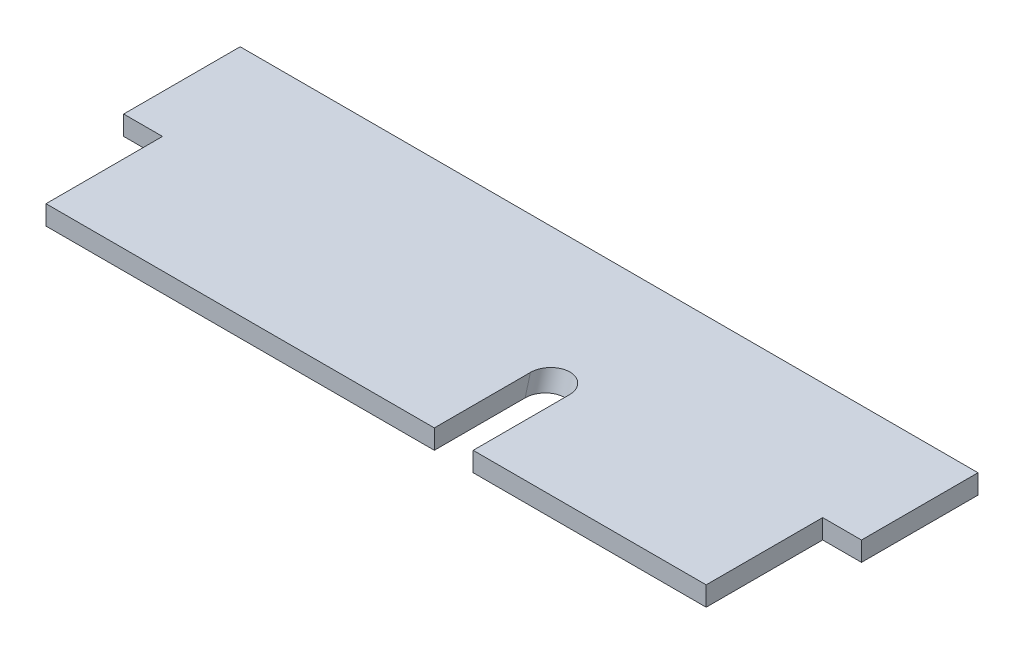
ISO-10303-21;
HEADER;
FILE_DESCRIPTION(('STEP AP214'),'2;1');
FILE_NAME('part.step','',(''),(''),'','','');
FILE_SCHEMA(('AUTOMOTIVE_DESIGN { 1 0 10303 214 1 1 1 1 }'));
ENDSEC;
DATA;
#1=APPLICATION_CONTEXT('core data for automotive mechanical design processes');
#2=APPLICATION_PROTOCOL_DEFINITION('international standard','automotive_design',2000,#1);
#3=PRODUCT_CONTEXT('',#1,'mechanical');
#4=PRODUCT('Part','Part','',(#3));
#5=PRODUCT_RELATED_PRODUCT_CATEGORY('part','',(#4));
#6=PRODUCT_DEFINITION_FORMATION('','',#4);
#7=PRODUCT_DEFINITION_CONTEXT('part definition',#1,'design');
#8=PRODUCT_DEFINITION('design','',#6,#7);
#9=PRODUCT_DEFINITION_SHAPE('','',#8);
#10=(LENGTH_UNIT() NAMED_UNIT(*) SI_UNIT(.MILLI.,.METRE.));
#11=(NAMED_UNIT(*) PLANE_ANGLE_UNIT() SI_UNIT($,.RADIAN.));
#12=(NAMED_UNIT(*) SI_UNIT($,.STERADIAN.) SOLID_ANGLE_UNIT());
#13=UNCERTAINTY_MEASURE_WITH_UNIT(LENGTH_MEASURE(1.E-05),#10,'distance_accuracy_value','');
#14=(GEOMETRIC_REPRESENTATION_CONTEXT(3) GLOBAL_UNCERTAINTY_ASSIGNED_CONTEXT((#13)) GLOBAL_UNIT_ASSIGNED_CONTEXT((#10,
#11,#12)) REPRESENTATION_CONTEXT('',''));
#15=CARTESIAN_POINT('',(0.,0.,0.));
#16=DIRECTION('',(0.,0.,1.));
#17=DIRECTION('',(1.,0.,0.));
#18=AXIS2_PLACEMENT_3D('',#15,#16,#17);
#19=CARTESIAN_POINT('',(-215.9,6.35,76.2));
#20=DIRECTION('',(0.,0.,-1.));
#21=DIRECTION('',(-1.,0.,0.));
#22=AXIS2_PLACEMENT_3D('',#19,#20,#21);
#23=PLANE('',#22);
#24=DIRECTION('',(1.,0.,0.));
#25=VECTOR('',#24,1.);
#26=CARTESIAN_POINT('',(-215.9,-6.35,76.2));
#27=LINE('',#26,#25);
#28=CARTESIAN_POINT('',(-215.9,-6.35,76.2));
#29=VERTEX_POINT('',#28);
#30=CARTESIAN_POINT('',(38.0999999999999,-6.35,76.2));
#31=VERTEX_POINT('',#30);
#32=EDGE_CURVE('E178',#29,#31,#27,.T.);
#33=ORIENTED_EDGE('',*,*,#32,.T.);
#34=DIRECTION('',(0.,-1.,0.));
#35=VECTOR('',#34,1.);
#36=CARTESIAN_POINT('',(38.0999999999999,6.34999999999999,76.2));
#37=LINE('',#36,#35);
#38=CARTESIAN_POINT('',(38.0999999999999,6.34999999999999,76.2));
#39=VERTEX_POINT('',#38);
#40=EDGE_CURVE('E275',#39,#31,#37,.T.);
#41=ORIENTED_EDGE('',*,*,#40,.F.);
#42=DIRECTION('',(1.,0.,0.));
#43=VECTOR('',#42,1.);
#44=CARTESIAN_POINT('',(-215.9,6.35,76.2));
#45=LINE('',#44,#43);
#46=CARTESIAN_POINT('',(-215.9,6.35,76.2));
#47=VERTEX_POINT('',#46);
#48=EDGE_CURVE('E56',#47,#39,#45,.T.);
#49=ORIENTED_EDGE('',*,*,#48,.F.);
#50=DIRECTION('',(0.,-1.,0.));
#51=VECTOR('',#50,1.);
#52=CARTESIAN_POINT('',(-215.9,6.35,76.2));
#53=LINE('',#52,#51);
#54=EDGE_CURVE('E172',#47,#29,#53,.T.);
#55=ORIENTED_EDGE('',*,*,#54,.T.);
#56=EDGE_LOOP('',(#33,#41,#49,#55));
#57=FACE_BOUND('',#56,.T.);
#58=ADVANCED_FACE('F46',(#57),#23,.F.);
#59=CARTESIAN_POINT('',(50.7999999999986,94.7896928963142,-10.6042856199856));
#60=DIRECTION('',(0.,-0.965182723476007,0.261576585923584));
#61=DIRECTION('',(0.,-0.261576585923584,-0.965182723476007));
#62=AXIS2_PLACEMENT_3D('',#59,#60,#61);
#63=CYLINDRICAL_SURFACE('',#62,12.7000000000001);
#64=CARTESIAN_POINT('',(50.7999999999986,6.34999999999999,13.363976933072));
#65=DIRECTION('',(0.,1.,0.));
#66=DIRECTION('',(0.,0.,1.));
#67=AXIS2_PLACEMENT_3D('',#64,#65,#66);
#68=ELLIPSE('',#67,13.1581302597941,12.7000000000001);
#69=CARTESIAN_POINT('',(38.0999999999992,6.34999999999999,13.363976933072));
#70=VERTEX_POINT('',#69);
#71=CARTESIAN_POINT('',(63.4999999999994,6.34999999999999,13.363976933072));
#72=VERTEX_POINT('',#71);
#73=EDGE_CURVE('E50',#70,#72,#68,.F.);
#74=ORIENTED_EDGE('',*,*,#73,.F.);
#75=DIRECTION('',(0.,-0.965182723476007,0.261576585923584));
#76=VECTOR('',#75,1.);
#77=CARTESIAN_POINT('',(38.0999999999992,94.7896928963142,-10.6042856199856));
#78=LINE('',#77,#76);
#79=CARTESIAN_POINT('',(38.0999999999985,-6.34999999999999,16.8058357235667));
#80=VERTEX_POINT('',#79);
#81=EDGE_CURVE('E151',#80,#70,#78,.F.);
#82=ORIENTED_EDGE('',*,*,#81,.F.);
#83=CARTESIAN_POINT('',(50.7999999999986,-6.34999999999999,16.8058357235667));
#84=DIRECTION('',(0.,1.,0.));
#85=DIRECTION('',(0.,0.,1.));
#86=AXIS2_PLACEMENT_3D('',#83,#84,#85);
#87=ELLIPSE('',#86,13.1581302597941,12.7000000000001);
#88=CARTESIAN_POINT('',(63.4999999999987,-6.34999999999999,16.8058357235667));
#89=VERTEX_POINT('',#88);
#90=EDGE_CURVE('E11',#80,#89,#87,.F.);
#91=ORIENTED_EDGE('',*,*,#90,.T.);
#92=DIRECTION('',(0.,-0.965182723476007,0.261576585923584));
#93=VECTOR('',#92,1.);
#94=CARTESIAN_POINT('',(63.4999999999994,94.7896928963142,-10.6042856199856));
#95=LINE('',#94,#93);
#96=EDGE_CURVE('E160',#89,#72,#95,.F.);
#97=ORIENTED_EDGE('',*,*,#96,.T.);
#98=EDGE_LOOP('',(#74,#82,#91,#97));
#99=FACE_BOUND('',#98,.T.);
#100=ADVANCED_FACE('F169',(#99),#63,.F.);
#101=CARTESIAN_POINT('',(215.9,6.35,0.));
#102=DIRECTION('',(-1.,0.,0.));
#103=DIRECTION('',(0.,0.,1.));
#104=AXIS2_PLACEMENT_3D('',#101,#102,#103);
#105=PLANE('',#104);
#106=DIRECTION('',(0.,0.,-1.));
#107=VECTOR('',#106,1.);
#108=CARTESIAN_POINT('',(215.9,-6.35,0.));
#109=LINE('',#108,#107);
#110=CARTESIAN_POINT('',(215.9,-6.35,76.2));
#111=VERTEX_POINT('',#110);
#112=CARTESIAN_POINT('',(215.9,-6.35,0.));
#113=VERTEX_POINT('',#112);
#114=EDGE_CURVE('E195',#111,#113,#109,.T.);
#115=ORIENTED_EDGE('',*,*,#114,.T.);
#116=DIRECTION('',(0.,-1.,0.));
#117=VECTOR('',#116,1.);
#118=CARTESIAN_POINT('',(215.9,6.35,0.));
#119=LINE('',#118,#117);
#120=CARTESIAN_POINT('',(215.9,6.35,0.));
#121=VERTEX_POINT('',#120);
#122=EDGE_CURVE('E214',#121,#113,#119,.T.);
#123=ORIENTED_EDGE('',*,*,#122,.F.);
#124=DIRECTION('',(0.,0.,-1.));
#125=VECTOR('',#124,1.);
#126=CARTESIAN_POINT('',(215.9,6.35,0.));
#127=LINE('',#126,#125);
#128=CARTESIAN_POINT('',(215.9,6.35,76.2));
#129=VERTEX_POINT('',#128);
#130=EDGE_CURVE('E171',#129,#121,#127,.T.);
#131=ORIENTED_EDGE('',*,*,#130,.F.);
#132=DIRECTION('',(0.,-1.,0.));
#133=VECTOR('',#132,1.);
#134=CARTESIAN_POINT('',(215.9,6.35,76.2));
#135=LINE('',#134,#133);
#136=EDGE_CURVE('E191',#129,#111,#135,.T.);
#137=ORIENTED_EDGE('',*,*,#136,.T.);
#138=EDGE_LOOP('',(#115,#123,#131,#137));
#139=FACE_BOUND('',#138,.T.);
#140=ADVANCED_FACE('F303',(#139),#105,.F.);
#141=CARTESIAN_POINT('',(215.9,6.35,0.));
#142=DIRECTION('',(0.,0.,-1.));
#143=DIRECTION('',(-1.,0.,0.));
#144=AXIS2_PLACEMENT_3D('',#141,#142,#143);
#145=PLANE('',#144);
#146=DIRECTION('',(1.,0.,0.));
#147=VECTOR('',#146,1.);
#148=CARTESIAN_POINT('',(215.9,-6.35,0.));
#149=LINE('',#148,#147);
#150=CARTESIAN_POINT('',(241.3,-6.35,0.));
#151=VERTEX_POINT('',#150);
#152=EDGE_CURVE('E194',#113,#151,#149,.T.);
#153=ORIENTED_EDGE('',*,*,#152,.T.);
#154=DIRECTION('',(0.,-1.,0.));
#155=VECTOR('',#154,1.);
#156=CARTESIAN_POINT('',(241.3,6.35,0.));
#157=LINE('',#156,#155);
#158=CARTESIAN_POINT('',(241.3,6.35,0.));
#159=VERTEX_POINT('',#158);
#160=EDGE_CURVE('E209',#159,#151,#157,.T.);
#161=ORIENTED_EDGE('',*,*,#160,.F.);
#162=DIRECTION('',(1.,0.,0.));
#163=VECTOR('',#162,1.);
#164=CARTESIAN_POINT('',(215.9,6.35,0.));
#165=LINE('',#164,#163);
#166=EDGE_CURVE('E176',#121,#159,#165,.T.);
#167=ORIENTED_EDGE('',*,*,#166,.F.);
#168=ORIENTED_EDGE('',*,*,#122,.T.);
#169=EDGE_LOOP('',(#153,#161,#167,#168));
#170=FACE_BOUND('',#169,.T.);
#171=ADVANCED_FACE('F245',(#170),#145,.F.);
#172=CARTESIAN_POINT('',(241.3,6.35,-76.2));
#173=DIRECTION('',(-1.,0.,0.));
#174=DIRECTION('',(0.,0.,1.));
#175=AXIS2_PLACEMENT_3D('',#172,#173,#174);
#176=PLANE('',#175);
#177=DIRECTION('',(0.,0.,-1.));
#178=VECTOR('',#177,1.);
#179=CARTESIAN_POINT('',(241.3,-6.35,-76.2));
#180=LINE('',#179,#178);
#181=CARTESIAN_POINT('',(241.3,-6.35,-76.2));
#182=VERTEX_POINT('',#181);
#183=EDGE_CURVE('E210',#151,#182,#180,.T.);
#184=ORIENTED_EDGE('',*,*,#183,.T.);
#185=DIRECTION('',(0.,-1.,0.));
#186=VECTOR('',#185,1.);
#187=CARTESIAN_POINT('',(241.3,6.35,-76.2));
#188=LINE('',#187,#186);
#189=CARTESIAN_POINT('',(241.3,6.35,-76.2));
#190=VERTEX_POINT('',#189);
#191=EDGE_CURVE('E205',#190,#182,#188,.T.);
#192=ORIENTED_EDGE('',*,*,#191,.F.);
#193=DIRECTION('',(0.,0.,-1.));
#194=VECTOR('',#193,1.);
#195=CARTESIAN_POINT('',(241.3,6.35,-76.2));
#196=LINE('',#195,#194);
#197=EDGE_CURVE('E232',#159,#190,#196,.T.);
#198=ORIENTED_EDGE('',*,*,#197,.F.);
#199=ORIENTED_EDGE('',*,*,#160,.T.);
#200=EDGE_LOOP('',(#184,#192,#198,#199));
#201=FACE_BOUND('',#200,.T.);
#202=ADVANCED_FACE('F250',(#201),#176,.F.);
#203=CARTESIAN_POINT('',(-215.9,6.35,-76.2));
#204=DIRECTION('',(0.,0.,1.));
#205=DIRECTION('',(1.,0.,0.));
#206=AXIS2_PLACEMENT_3D('',#203,#204,#205);
#207=PLANE('',#206);
#208=DIRECTION('',(-1.,0.,0.));
#209=VECTOR('',#208,1.);
#210=CARTESIAN_POINT('',(-215.9,-6.35,-76.2));
#211=LINE('',#210,#209);
#212=CARTESIAN_POINT('',(-241.3,-6.35,-76.2));
#213=VERTEX_POINT('',#212);
#214=EDGE_CURVE('E206',#182,#213,#211,.T.);
#215=ORIENTED_EDGE('',*,*,#214,.T.);
#216=DIRECTION('',(0.,-1.,0.));
#217=VECTOR('',#216,1.);
#218=CARTESIAN_POINT('',(-241.3,6.35,-76.2));
#219=LINE('',#218,#217);
#220=CARTESIAN_POINT('',(-241.3,6.35,-76.2));
#221=VERTEX_POINT('',#220);
#222=EDGE_CURVE('E202',#221,#213,#219,.T.);
#223=ORIENTED_EDGE('',*,*,#222,.F.);
#224=DIRECTION('',(-1.,0.,0.));
#225=VECTOR('',#224,1.);
#226=CARTESIAN_POINT('',(215.9,6.35,-76.2));
#227=LINE('',#226,#225);
#228=EDGE_CURVE('E229',#190,#221,#227,.T.);
#229=ORIENTED_EDGE('',*,*,#228,.F.);
#230=ORIENTED_EDGE('',*,*,#191,.T.);
#231=EDGE_LOOP('',(#215,#223,#229,#230));
#232=FACE_BOUND('',#231,.T.);
#233=ADVANCED_FACE('F257',(#232),#207,.F.);
#234=CARTESIAN_POINT('',(-241.3,6.35,-76.2));
#235=DIRECTION('',(1.,0.,0.));
#236=DIRECTION('',(0.,0.,-1.));
#237=AXIS2_PLACEMENT_3D('',#234,#235,#236);
#238=PLANE('',#237);
#239=DIRECTION('',(0.,0.,1.));
#240=VECTOR('',#239,1.);
#241=CARTESIAN_POINT('',(-241.3,-6.35,-76.2));
#242=LINE('',#241,#240);
#243=CARTESIAN_POINT('',(-241.3,-6.35,0.));
#244=VERTEX_POINT('',#243);
#245=EDGE_CURVE('E203',#213,#244,#242,.T.);
#246=ORIENTED_EDGE('',*,*,#245,.T.);
#247=DIRECTION('',(0.,-1.,0.));
#248=VECTOR('',#247,1.);
#249=CARTESIAN_POINT('',(-241.3,6.35,0.));
#250=LINE('',#249,#248);
#251=CARTESIAN_POINT('',(-241.3,6.35,0.));
#252=VERTEX_POINT('',#251);
#253=EDGE_CURVE('E199',#252,#244,#250,.T.);
#254=ORIENTED_EDGE('',*,*,#253,.F.);
#255=DIRECTION('',(0.,0.,1.));
#256=VECTOR('',#255,1.);
#257=CARTESIAN_POINT('',(-241.3,6.35,-76.2));
#258=LINE('',#257,#256);
#259=EDGE_CURVE('E227',#221,#252,#258,.T.);
#260=ORIENTED_EDGE('',*,*,#259,.F.);
#261=ORIENTED_EDGE('',*,*,#222,.T.);
#262=EDGE_LOOP('',(#246,#254,#260,#261));
#263=FACE_BOUND('',#262,.T.);
#264=ADVANCED_FACE('F265',(#263),#238,.F.);
#265=CARTESIAN_POINT('',(-215.9,6.35,0.));
#266=DIRECTION('',(0.,0.,-1.));
#267=DIRECTION('',(-1.,0.,0.));
#268=AXIS2_PLACEMENT_3D('',#265,#266,#267);
#269=PLANE('',#268);
#270=DIRECTION('',(1.,0.,0.));
#271=VECTOR('',#270,1.);
#272=CARTESIAN_POINT('',(-215.9,-6.35,0.));
#273=LINE('',#272,#271);
#274=CARTESIAN_POINT('',(-215.9,-6.35,0.));
#275=VERTEX_POINT('',#274);
#276=EDGE_CURVE('E200',#244,#275,#273,.T.);
#277=ORIENTED_EDGE('',*,*,#276,.T.);
#278=DIRECTION('',(0.,-1.,0.));
#279=VECTOR('',#278,1.);
#280=CARTESIAN_POINT('',(-215.9,6.35,0.));
#281=LINE('',#280,#279);
#282=CARTESIAN_POINT('',(-215.9,6.35,0.));
#283=VERTEX_POINT('',#282);
#284=EDGE_CURVE('E189',#283,#275,#281,.T.);
#285=ORIENTED_EDGE('',*,*,#284,.F.);
#286=DIRECTION('',(1.,0.,0.));
#287=VECTOR('',#286,1.);
#288=CARTESIAN_POINT('',(-215.9,6.35,0.));
#289=LINE('',#288,#287);
#290=EDGE_CURVE('E225',#252,#283,#289,.T.);
#291=ORIENTED_EDGE('',*,*,#290,.F.);
#292=ORIENTED_EDGE('',*,*,#253,.T.);
#293=EDGE_LOOP('',(#277,#285,#291,#292));
#294=FACE_BOUND('',#293,.T.);
#295=ADVANCED_FACE('F269',(#294),#269,.F.);
#296=CARTESIAN_POINT('',(-215.9,6.35,0.));
#297=DIRECTION('',(1.,0.,0.));
#298=DIRECTION('',(0.,0.,-1.));
#299=AXIS2_PLACEMENT_3D('',#296,#297,#298);
#300=PLANE('',#299);
#301=DIRECTION('',(0.,0.,1.));
#302=VECTOR('',#301,1.);
#303=CARTESIAN_POINT('',(-215.9,-6.35,0.));
#304=LINE('',#303,#302);
#305=EDGE_CURVE('E197',#275,#29,#304,.T.);
#306=ORIENTED_EDGE('',*,*,#305,.T.);
#307=ORIENTED_EDGE('',*,*,#54,.F.);
#308=DIRECTION('',(0.,0.,1.));
#309=VECTOR('',#308,1.);
#310=CARTESIAN_POINT('',(-215.9,6.35,0.));
#311=LINE('',#310,#309);
#312=EDGE_CURVE('E223',#283,#47,#311,.T.);
#313=ORIENTED_EDGE('',*,*,#312,.F.);
#314=ORIENTED_EDGE('',*,*,#284,.T.);
#315=EDGE_LOOP('',(#306,#307,#313,#314));
#316=FACE_BOUND('',#315,.T.);
#317=ADVANCED_FACE('F274',(#316),#300,.F.);
#318=CARTESIAN_POINT('',(63.5000000000001,6.34999999999999,76.2));
#319=VERTEX_POINT('',#318);
#320=EDGE_CURVE('E222',#319,#129,#45,.T.);
#321=ORIENTED_EDGE('',*,*,#320,.F.);
#322=DIRECTION('',(0.,1.,0.));
#323=VECTOR('',#322,1.);
#324=CARTESIAN_POINT('',(63.5000000000001,6.34999999999999,76.2));
#325=LINE('',#324,#323);
#326=CARTESIAN_POINT('',(63.5000000000001,-6.35,76.2));
#327=VERTEX_POINT('',#326);
#328=EDGE_CURVE('E167',#327,#319,#325,.T.);
#329=ORIENTED_EDGE('',*,*,#328,.F.);
#330=EDGE_CURVE('E185',#327,#111,#27,.T.);
#331=ORIENTED_EDGE('',*,*,#330,.T.);
#332=ORIENTED_EDGE('',*,*,#136,.F.);
#333=EDGE_LOOP('',(#321,#329,#331,#332));
#334=FACE_BOUND('',#333,.T.);
#335=ADVANCED_FACE('F299',(#334),#23,.F.);
#336=CARTESIAN_POINT('',(0.,6.35,0.));
#337=DIRECTION('',(0.,1.,0.));
#338=DIRECTION('',(0.,0.,1.));
#339=AXIS2_PLACEMENT_3D('',#336,#337,#338);
#340=PLANE('',#339);
#341=DIRECTION('',(0.,0.,1.));
#342=VECTOR('',#341,1.);
#343=CARTESIAN_POINT('',(38.0999999999999,6.34999999999999,-76.201));
#344=LINE('',#343,#342);
#345=EDGE_CURVE('E154',#70,#39,#344,.T.);
#346=ORIENTED_EDGE('',*,*,#345,.F.);
#347=ORIENTED_EDGE('',*,*,#73,.T.);
#348=DIRECTION('',(0.,0.,1.));
#349=VECTOR('',#348,1.);
#350=CARTESIAN_POINT('',(63.5000000000001,6.34999999999999,-76.201));
#351=LINE('',#350,#349);
#352=EDGE_CURVE('E76',#72,#319,#351,.T.);
#353=ORIENTED_EDGE('',*,*,#352,.T.);
#354=ORIENTED_EDGE('',*,*,#320,.T.);
#355=ORIENTED_EDGE('',*,*,#130,.T.);
#356=ORIENTED_EDGE('',*,*,#166,.T.);
#357=ORIENTED_EDGE('',*,*,#197,.T.);
#358=ORIENTED_EDGE('',*,*,#228,.T.);
#359=ORIENTED_EDGE('',*,*,#259,.T.);
#360=ORIENTED_EDGE('',*,*,#290,.T.);
#361=ORIENTED_EDGE('',*,*,#312,.T.);
#362=ORIENTED_EDGE('',*,*,#48,.T.);
#363=EDGE_LOOP('',(#346,#347,#353,#354,#355,#356,#357,#358,#359,#360,#361,#362));
#364=FACE_BOUND('',#363,.T.);
#365=ADVANCED_FACE('F48',(#364),#340,.T.);
#366=CARTESIAN_POINT('',(0.,-6.35,0.));
#367=DIRECTION('',(0.,1.,0.));
#368=DIRECTION('',(0.,0.,1.));
#369=AXIS2_PLACEMENT_3D('',#366,#367,#368);
#370=PLANE('',#369);
#371=ORIENTED_EDGE('',*,*,#90,.F.);
#372=DIRECTION('',(0.,0.,1.));
#373=VECTOR('',#372,1.);
#374=CARTESIAN_POINT('',(38.0999999999999,-6.35,-76.201));
#375=LINE('',#374,#373);
#376=EDGE_CURVE('E67',#80,#31,#375,.T.);
#377=ORIENTED_EDGE('',*,*,#376,.T.);
#378=ORIENTED_EDGE('',*,*,#32,.F.);
#379=ORIENTED_EDGE('',*,*,#305,.F.);
#380=ORIENTED_EDGE('',*,*,#276,.F.);
#381=ORIENTED_EDGE('',*,*,#245,.F.);
#382=ORIENTED_EDGE('',*,*,#214,.F.);
#383=ORIENTED_EDGE('',*,*,#183,.F.);
#384=ORIENTED_EDGE('',*,*,#152,.F.);
#385=ORIENTED_EDGE('',*,*,#114,.F.);
#386=ORIENTED_EDGE('',*,*,#330,.F.);
#387=DIRECTION('',(0.,0.,1.));
#388=VECTOR('',#387,1.);
#389=CARTESIAN_POINT('',(63.5000000000001,-6.35,-76.201));
#390=LINE('',#389,#388);
#391=EDGE_CURVE('E285',#89,#327,#390,.T.);
#392=ORIENTED_EDGE('',*,*,#391,.F.);
#393=EDGE_LOOP('',(#371,#377,#378,#379,#380,#381,#382,#383,#384,#385,#386,#392));
#394=FACE_BOUND('',#393,.T.);
#395=ADVANCED_FACE('F291',(#394),#370,.F.);
#396=CARTESIAN_POINT('',(63.5000000000001,6.34999999999999,-76.201));
#397=DIRECTION('',(1.,0.,0.));
#398=DIRECTION('',(0.,0.,-1.));
#399=AXIS2_PLACEMENT_3D('',#396,#397,#398);
#400=PLANE('',#399);
#401=ORIENTED_EDGE('',*,*,#391,.T.);
#402=ORIENTED_EDGE('',*,*,#328,.T.);
#403=ORIENTED_EDGE('',*,*,#352,.F.);
#404=ORIENTED_EDGE('',*,*,#96,.F.);
#405=EDGE_LOOP('',(#401,#402,#403,#404));
#406=FACE_BOUND('',#405,.T.);
#407=ADVANCED_FACE('F296',(#406),#400,.F.);
#408=CARTESIAN_POINT('',(38.0999999999999,6.34999999999999,-76.201));
#409=DIRECTION('',(-1.,0.,0.));
#410=DIRECTION('',(0.,0.,1.));
#411=AXIS2_PLACEMENT_3D('',#408,#409,#410);
#412=PLANE('',#411);
#413=ORIENTED_EDGE('',*,*,#81,.T.);
#414=ORIENTED_EDGE('',*,*,#345,.T.);
#415=ORIENTED_EDGE('',*,*,#40,.T.);
#416=ORIENTED_EDGE('',*,*,#376,.F.);
#417=EDGE_LOOP('',(#413,#414,#415,#416));
#418=FACE_BOUND('',#417,.T.);
#419=ADVANCED_FACE('F153',(#418),#412,.F.);
#420=CLOSED_SHELL('',(#58,#100,#140,#171,#202,#233,#264,#295,#317,#335,#365,#395,#407,#419));
#421=MANIFOLD_SOLID_BREP('B2',#420);
#422=ADVANCED_BREP_SHAPE_REPRESENTATION('',(#18,#421),#14);
#423=SHAPE_DEFINITION_REPRESENTATION(#9,#422);
ENDSEC;
END-ISO-10303-21;
